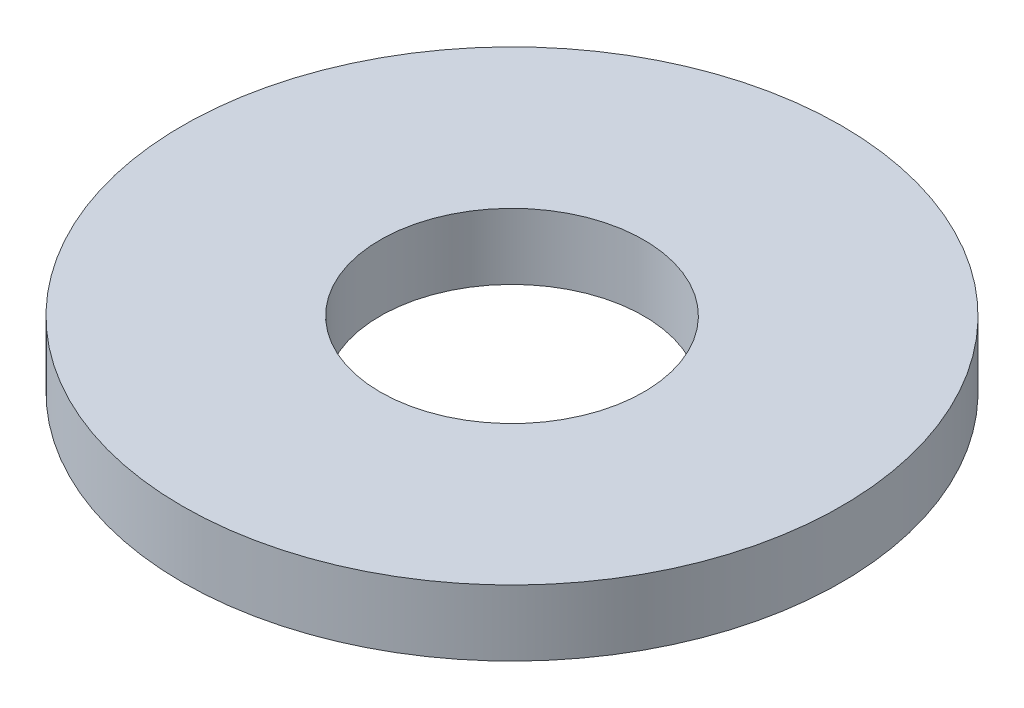
ISO-10303-21;
HEADER;
FILE_DESCRIPTION(('STEP AP214'),'2;1');
FILE_NAME('part.step','',(''),(''),'','','');
FILE_SCHEMA(('AUTOMOTIVE_DESIGN { 1 0 10303 214 1 1 1 1 }'));
ENDSEC;
DATA;
#1=APPLICATION_CONTEXT('core data for automotive mechanical design processes');
#2=APPLICATION_PROTOCOL_DEFINITION('international standard','automotive_design',2000,#1);
#3=PRODUCT_CONTEXT('',#1,'mechanical');
#4=PRODUCT('Part','Part','',(#3));
#5=PRODUCT_RELATED_PRODUCT_CATEGORY('part','',(#4));
#6=PRODUCT_DEFINITION_FORMATION('','',#4);
#7=PRODUCT_DEFINITION_CONTEXT('part definition',#1,'design');
#8=PRODUCT_DEFINITION('design','',#6,#7);
#9=PRODUCT_DEFINITION_SHAPE('','',#8);
#10=(LENGTH_UNIT() NAMED_UNIT(*) SI_UNIT(.MILLI.,.METRE.));
#11=(NAMED_UNIT(*) PLANE_ANGLE_UNIT() SI_UNIT($,.RADIAN.));
#12=(NAMED_UNIT(*) SI_UNIT($,.STERADIAN.) SOLID_ANGLE_UNIT());
#13=UNCERTAINTY_MEASURE_WITH_UNIT(LENGTH_MEASURE(1.E-05),#10,'distance_accuracy_value','');
#14=(GEOMETRIC_REPRESENTATION_CONTEXT(3) GLOBAL_UNCERTAINTY_ASSIGNED_CONTEXT((#13)) GLOBAL_UNIT_ASSIGNED_CONTEXT((#10,
#11,#12)) REPRESENTATION_CONTEXT('',''));
#15=CARTESIAN_POINT('',(0.,0.,0.));
#16=DIRECTION('',(0.,0.,1.));
#17=DIRECTION('',(1.,0.,0.));
#18=AXIS2_PLACEMENT_3D('',#15,#16,#17);
#19=CARTESIAN_POINT('',(0.,1.,0.));
#20=DIRECTION('',(0.,1.,0.));
#21=DIRECTION('',(0.,0.,1.));
#22=AXIS2_PLACEMENT_3D('',#19,#20,#21);
#23=PLANE('',#22);
#24=CARTESIAN_POINT('',(0.,1.,0.));
#25=DIRECTION('',(0.,1.,0.));
#26=DIRECTION('',(0.,0.,1.));
#27=AXIS2_PLACEMENT_3D('',#24,#25,#26);
#28=CIRCLE('',#27,5.);
#29=CARTESIAN_POINT('',(0.,1.,5.));
#30=VERTEX_POINT('',#29);
#31=EDGE_CURVE('E10',#30,#30,#28,.T.);
#32=ORIENTED_EDGE('',*,*,#31,.T.);
#33=EDGE_LOOP('',(#32));
#34=FACE_BOUND('',#33,.T.);
#35=CARTESIAN_POINT('',(0.,1.,0.));
#36=DIRECTION('',(0.,1.,0.));
#37=DIRECTION('',(0.,0.,1.));
#38=AXIS2_PLACEMENT_3D('',#35,#36,#37);
#39=CIRCLE('',#38,2.);
#40=CARTESIAN_POINT('',(0.,1.,2.));
#41=VERTEX_POINT('',#40);
#42=EDGE_CURVE('E50',#41,#41,#39,.T.);
#43=ORIENTED_EDGE('',*,*,#42,.F.);
#44=EDGE_LOOP('',(#43));
#45=FACE_BOUND('',#44,.T.);
#46=ADVANCED_FACE('F37',(#34,#45),#23,.T.);
#47=CARTESIAN_POINT('',(0.,0.,0.));
#48=DIRECTION('',(0.,1.,0.));
#49=DIRECTION('',(0.,0.,1.));
#50=AXIS2_PLACEMENT_3D('',#47,#48,#49);
#51=PLANE('',#50);
#52=CARTESIAN_POINT('',(0.,0.,0.));
#53=DIRECTION('',(0.,1.,0.));
#54=DIRECTION('',(0.,0.,1.));
#55=AXIS2_PLACEMENT_3D('',#52,#53,#54);
#56=CIRCLE('',#55,5.);
#57=CARTESIAN_POINT('',(0.,0.,5.));
#58=VERTEX_POINT('',#57);
#59=EDGE_CURVE('E41',#58,#58,#56,.T.);
#60=ORIENTED_EDGE('',*,*,#59,.F.);
#61=EDGE_LOOP('',(#60));
#62=FACE_BOUND('',#61,.T.);
#63=CARTESIAN_POINT('',(0.,0.,0.));
#64=DIRECTION('',(0.,1.,0.));
#65=DIRECTION('',(0.,0.,1.));
#66=AXIS2_PLACEMENT_3D('',#63,#64,#65);
#67=CIRCLE('',#66,2.);
#68=CARTESIAN_POINT('',(0.,0.,2.));
#69=VERTEX_POINT('',#68);
#70=EDGE_CURVE('E52',#69,#69,#67,.T.);
#71=ORIENTED_EDGE('',*,*,#70,.T.);
#72=EDGE_LOOP('',(#71));
#73=FACE_BOUND('',#72,.T.);
#74=ADVANCED_FACE('F64',(#62,#73),#51,.F.);
#75=CARTESIAN_POINT('',(0.,1.,0.));
#76=DIRECTION('',(0.,-1.,0.));
#77=DIRECTION('',(0.,0.,-1.));
#78=AXIS2_PLACEMENT_3D('',#75,#76,#77);
#79=CYLINDRICAL_SURFACE('',#78,5.);
#80=ORIENTED_EDGE('',*,*,#31,.F.);
#81=EDGE_LOOP('',(#80));
#82=FACE_BOUND('',#81,.T.);
#83=ORIENTED_EDGE('',*,*,#59,.T.);
#84=EDGE_LOOP('',(#83));
#85=FACE_BOUND('',#84,.T.);
#86=ADVANCED_FACE('F39',(#82,#85),#79,.T.);
#87=CARTESIAN_POINT('',(0.,1.,0.));
#88=DIRECTION('',(0.,-1.,0.));
#89=DIRECTION('',(0.,0.,-1.));
#90=AXIS2_PLACEMENT_3D('',#87,#88,#89);
#91=CYLINDRICAL_SURFACE('',#90,2.);
#92=ORIENTED_EDGE('',*,*,#42,.T.);
#93=EDGE_LOOP('',(#92));
#94=FACE_BOUND('',#93,.T.);
#95=ORIENTED_EDGE('',*,*,#70,.F.);
#96=EDGE_LOOP('',(#95));
#97=FACE_BOUND('',#96,.T.);
#98=ADVANCED_FACE('F60',(#94,#97),#91,.F.);
#99=CLOSED_SHELL('',(#46,#74,#86,#98));
#100=MANIFOLD_SOLID_BREP('B2',#99);
#101=ADVANCED_BREP_SHAPE_REPRESENTATION('',(#18,#100),#14);
#102=SHAPE_DEFINITION_REPRESENTATION(#9,#101);
ENDSEC;
END-ISO-10303-21;
